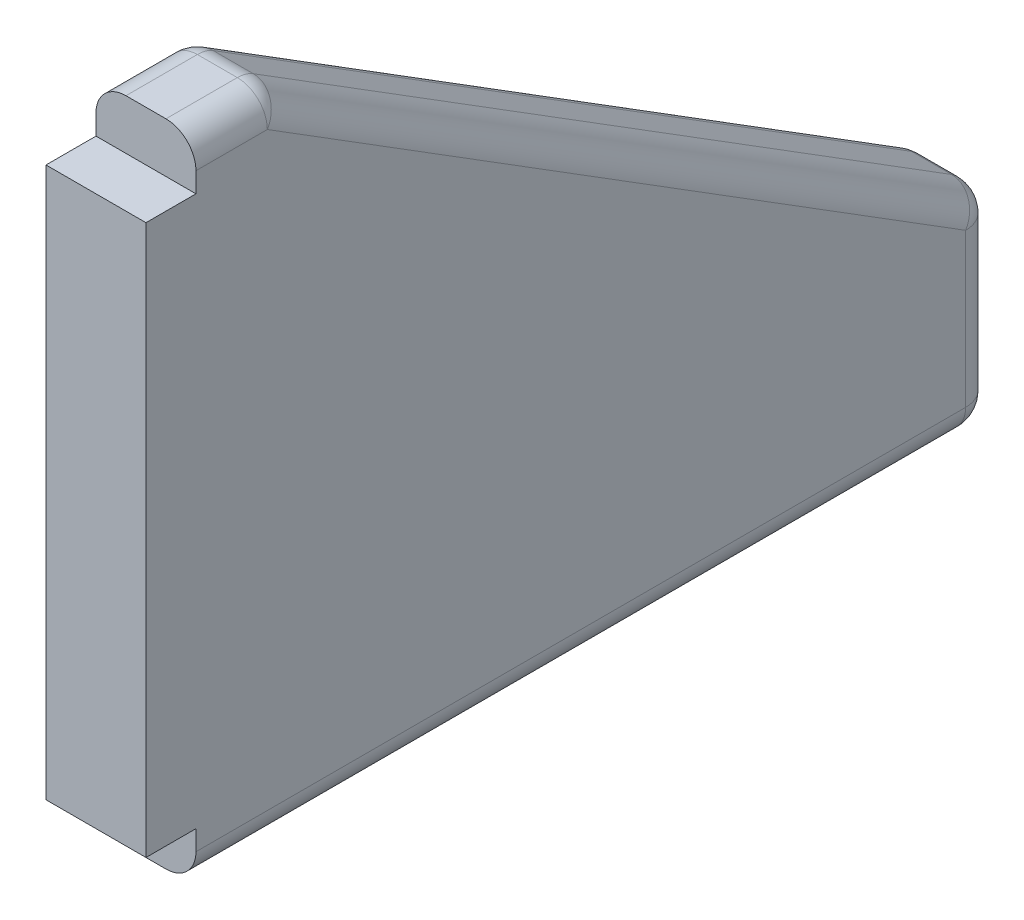
ISO-10303-21;
HEADER;
FILE_DESCRIPTION(('STEP AP214'),'2;1');
FILE_NAME('part.step','',(''),(''),'','','');
FILE_SCHEMA(('AUTOMOTIVE_DESIGN { 1 0 10303 214 1 1 1 1 }'));
ENDSEC;
DATA;
#1=APPLICATION_CONTEXT('core data for automotive mechanical design processes');
#2=APPLICATION_PROTOCOL_DEFINITION('international standard','automotive_design',2000,#1);
#3=PRODUCT_CONTEXT('',#1,'mechanical');
#4=PRODUCT('Part','Part','',(#3));
#5=PRODUCT_RELATED_PRODUCT_CATEGORY('part','',(#4));
#6=PRODUCT_DEFINITION_FORMATION('','',#4);
#7=PRODUCT_DEFINITION_CONTEXT('part definition',#1,'design');
#8=PRODUCT_DEFINITION('design','',#6,#7);
#9=PRODUCT_DEFINITION_SHAPE('','',#8);
#10=(LENGTH_UNIT() NAMED_UNIT(*) SI_UNIT(.MILLI.,.METRE.));
#11=(NAMED_UNIT(*) PLANE_ANGLE_UNIT() SI_UNIT($,.RADIAN.));
#12=(NAMED_UNIT(*) SI_UNIT($,.STERADIAN.) SOLID_ANGLE_UNIT());
#13=UNCERTAINTY_MEASURE_WITH_UNIT(LENGTH_MEASURE(1.E-05),#10,'distance_accuracy_value','');
#14=(GEOMETRIC_REPRESENTATION_CONTEXT(3) GLOBAL_UNCERTAINTY_ASSIGNED_CONTEXT((#13)) GLOBAL_UNIT_ASSIGNED_CONTEXT((#10,
#11,#12)) REPRESENTATION_CONTEXT('',''));
#15=CARTESIAN_POINT('',(0.,0.,0.));
#16=DIRECTION('',(0.,0.,1.));
#17=DIRECTION('',(1.,0.,0.));
#18=AXIS2_PLACEMENT_3D('',#15,#16,#17);
#19=CARTESIAN_POINT('',(10.,0.,-80.));
#20=DIRECTION('',(0.,1.,0.));
#21=DIRECTION('',(0.,0.,1.));
#22=AXIS2_PLACEMENT_3D('',#19,#20,#21);
#23=PLANE('',#22);
#24=DIRECTION('',(-1.,0.,0.));
#25=VECTOR('',#24,1.);
#26=CARTESIAN_POINT('',(10.,0.,0.));
#27=LINE('',#26,#25);
#28=CARTESIAN_POINT('',(7.,0.,0.));
#29=VERTEX_POINT('',#28);
#30=CARTESIAN_POINT('',(3.,0.,0.));
#31=VERTEX_POINT('',#30);
#32=EDGE_CURVE('E199',#29,#31,#27,.T.);
#33=ORIENTED_EDGE('',*,*,#32,.T.);
#34=DIRECTION('',(0.,0.,-1.));
#35=VECTOR('',#34,1.);
#36=CARTESIAN_POINT('',(3.,0.,-80.));
#37=LINE('',#36,#35);
#38=CARTESIAN_POINT('',(3.,0.,-77.));
#39=VERTEX_POINT('',#38);
#40=EDGE_CURVE('E274',#31,#39,#37,.T.);
#41=ORIENTED_EDGE('',*,*,#40,.T.);
#42=DIRECTION('',(-1.,0.,0.));
#43=VECTOR('',#42,1.);
#44=CARTESIAN_POINT('',(10.,0.,-77.));
#45=LINE('',#44,#43);
#46=CARTESIAN_POINT('',(7.,0.,-77.));
#47=VERTEX_POINT('',#46);
#48=EDGE_CURVE('E268',#39,#47,#45,.F.);
#49=ORIENTED_EDGE('',*,*,#48,.T.);
#50=DIRECTION('',(0.,0.,-1.));
#51=VECTOR('',#50,1.);
#52=CARTESIAN_POINT('',(7.,0.,-80.));
#53=LINE('',#52,#51);
#54=EDGE_CURVE('E271',#47,#29,#53,.F.);
#55=ORIENTED_EDGE('',*,*,#54,.T.);
#56=EDGE_LOOP('',(#33,#41,#49,#55));
#57=FACE_BOUND('',#56,.T.);
#58=ADVANCED_FACE('F41',(#57),#23,.F.);
#59=CARTESIAN_POINT('',(10.,20.,-80.));
#60=DIRECTION('',(0.,0.,1.));
#61=DIRECTION('',(1.,0.,0.));
#62=AXIS2_PLACEMENT_3D('',#59,#60,#61);
#63=PLANE('',#62);
#64=DIRECTION('',(0.,1.,0.));
#65=VECTOR('',#64,1.);
#66=CARTESIAN_POINT('',(7.,20.,-80.));
#67=LINE('',#66,#65);
#68=CARTESIAN_POINT('',(7.,18.3372570754788,-80.));
#69=VERTEX_POINT('',#68);
#70=CARTESIAN_POINT('',(7.,3.,-80.));
#71=VERTEX_POINT('',#70);
#72=EDGE_CURVE('E289',#69,#71,#67,.F.);
#73=ORIENTED_EDGE('',*,*,#72,.T.);
#74=DIRECTION('',(-1.,0.,0.));
#75=VECTOR('',#74,1.);
#76=CARTESIAN_POINT('',(10.,3.,-80.));
#77=LINE('',#76,#75);
#78=CARTESIAN_POINT('',(3.,3.,-80.));
#79=VERTEX_POINT('',#78);
#80=EDGE_CURVE('E292',#71,#79,#77,.T.);
#81=ORIENTED_EDGE('',*,*,#80,.T.);
#82=DIRECTION('',(0.,1.,0.));
#83=VECTOR('',#82,1.);
#84=CARTESIAN_POINT('',(3.,20.,-80.));
#85=LINE('',#84,#83);
#86=CARTESIAN_POINT('',(3.,18.3372570754788,-80.));
#87=VERTEX_POINT('',#86);
#88=EDGE_CURVE('E286',#79,#87,#85,.T.);
#89=ORIENTED_EDGE('',*,*,#88,.T.);
#90=DIRECTION('',(-1.,0.,0.));
#91=VECTOR('',#90,1.);
#92=CARTESIAN_POINT('',(10.,18.3372570754788,-80.));
#93=LINE('',#92,#91);
#94=EDGE_CURVE('E283',#87,#69,#93,.F.);
#95=ORIENTED_EDGE('',*,*,#94,.T.);
#96=EDGE_LOOP('',(#73,#81,#89,#95));
#97=FACE_BOUND('',#96,.T.);
#98=ADVANCED_FACE('F461',(#97),#63,.F.);
#99=CARTESIAN_POINT('',(10.,65.,-8.));
#100=DIRECTION('',(0.,-0.847998304005088,0.52999894000318));
#101=DIRECTION('',(0.,-0.52999894000318,-0.847998304005088));
#102=AXIS2_PLACEMENT_3D('',#99,#100,#101);
#103=PLANE('',#102);
#104=DIRECTION('',(-1.,0.,0.));
#105=VECTOR('',#104,1.);
#106=CARTESIAN_POINT('',(10.,20.881251987494,-78.5899968200096));
#107=LINE('',#106,#105);
#108=CARTESIAN_POINT('',(7.,20.881251987494,-78.5899968200095));
#109=VERTEX_POINT('',#108);
#110=CARTESIAN_POINT('',(3.,20.881251987494,-78.5899968200095));
#111=VERTEX_POINT('',#110);
#112=EDGE_CURVE('E51',#109,#111,#107,.T.);
#113=ORIENTED_EDGE('',*,*,#112,.T.);
#114=DIRECTION('',(0.,0.52999894000318,0.847998304005088));
#115=VECTOR('',#114,1.);
#116=CARTESIAN_POINT('',(3.,65.,-8.));
#117=LINE('',#116,#115);
#118=CARTESIAN_POINT('',(3.,64.5439949120153,-8.72960814077558));
#119=VERTEX_POINT('',#118);
#120=EDGE_CURVE('E11',#111,#119,#117,.T.);
#121=ORIENTED_EDGE('',*,*,#120,.T.);
#122=DIRECTION('',(-1.,0.,0.));
#123=VECTOR('',#122,1.);
#124=CARTESIAN_POINT('',(10.,64.5439949120153,-8.72960814077558));
#125=LINE('',#124,#123);
#126=CARTESIAN_POINT('',(7.,64.5439949120153,-8.72960814077558));
#127=VERTEX_POINT('',#126);
#128=EDGE_CURVE('E299',#119,#127,#125,.F.);
#129=ORIENTED_EDGE('',*,*,#128,.T.);
#130=DIRECTION('',(0.,0.52999894000318,0.847998304005088));
#131=VECTOR('',#130,1.);
#132=CARTESIAN_POINT('',(7.,65.,-8.));
#133=LINE('',#132,#131);
#134=EDGE_CURVE('E296',#127,#109,#133,.F.);
#135=ORIENTED_EDGE('',*,*,#134,.T.);
#136=EDGE_LOOP('',(#113,#121,#129,#135));
#137=FACE_BOUND('',#136,.T.);
#138=ADVANCED_FACE('F443',(#137),#103,.F.);
#139=CARTESIAN_POINT('',(10.,65.,0.));
#140=DIRECTION('',(0.,-1.,0.));
#141=DIRECTION('',(0.,0.,-1.));
#142=AXIS2_PLACEMENT_3D('',#139,#140,#141);
#143=PLANE('',#142);
#144=DIRECTION('',(-1.,0.,0.));
#145=VECTOR('',#144,1.);
#146=CARTESIAN_POINT('',(10.,65.,0.));
#147=LINE('',#146,#145);
#148=CARTESIAN_POINT('',(7.,65.,0.));
#149=VERTEX_POINT('',#148);
#150=CARTESIAN_POINT('',(3.,65.,0.));
#151=VERTEX_POINT('',#150);
#152=EDGE_CURVE('E180',#149,#151,#147,.T.);
#153=ORIENTED_EDGE('',*,*,#152,.F.);
#154=DIRECTION('',(0.,0.,1.));
#155=VECTOR('',#154,1.);
#156=CARTESIAN_POINT('',(7.,65.,0.));
#157=LINE('',#156,#155);
#158=CARTESIAN_POINT('',(7.,65.,-7.13961132076604));
#159=VERTEX_POINT('',#158);
#160=EDGE_CURVE('E253',#149,#159,#157,.F.);
#161=ORIENTED_EDGE('',*,*,#160,.T.);
#162=DIRECTION('',(-1.,0.,0.));
#163=VECTOR('',#162,1.);
#164=CARTESIAN_POINT('',(10.,65.,-7.13961132076604));
#165=LINE('',#164,#163);
#166=CARTESIAN_POINT('',(3.,65.,-7.13961132076604));
#167=VERTEX_POINT('',#166);
#168=EDGE_CURVE('E247',#159,#167,#165,.T.);
#169=ORIENTED_EDGE('',*,*,#168,.T.);
#170=DIRECTION('',(0.,0.,1.));
#171=VECTOR('',#170,1.);
#172=CARTESIAN_POINT('',(3.,65.,0.));
#173=LINE('',#172,#171);
#174=EDGE_CURVE('E250',#167,#151,#173,.T.);
#175=ORIENTED_EDGE('',*,*,#174,.T.);
#176=EDGE_LOOP('',(#153,#161,#169,#175));
#177=FACE_BOUND('',#176,.T.);
#178=ADVANCED_FACE('F430',(#177),#143,.F.);
#179=CARTESIAN_POINT('',(10.,60.,0.));
#180=DIRECTION('',(0.,0.,-1.));
#181=DIRECTION('',(0.,1.,0.));
#182=AXIS2_PLACEMENT_3D('',#179,#180,#181);
#183=PLANE('',#182);
#184=DIRECTION('',(0.,-1.,0.));
#185=VECTOR('',#184,1.);
#186=CARTESIAN_POINT('',(10.,60.,0.));
#187=LINE('',#186,#185);
#188=CARTESIAN_POINT('',(10.,62.,0.));
#189=VERTEX_POINT('',#188);
#190=CARTESIAN_POINT('',(10.,60.,0.));
#191=VERTEX_POINT('',#190);
#192=EDGE_CURVE('E160',#189,#191,#187,.T.);
#193=ORIENTED_EDGE('',*,*,#192,.F.);
#194=CARTESIAN_POINT('',(7.,62.,0.));
#195=DIRECTION('',(0.,0.,-1.));
#196=DIRECTION('',(0.,1.,0.));
#197=AXIS2_PLACEMENT_3D('',#194,#195,#196);
#198=CIRCLE('',#197,3.);
#199=EDGE_CURVE('E244',#189,#149,#198,.F.);
#200=ORIENTED_EDGE('',*,*,#199,.T.);
#201=ORIENTED_EDGE('',*,*,#152,.T.);
#202=CARTESIAN_POINT('',(3.,62.,0.));
#203=DIRECTION('',(0.,0.,-1.));
#204=DIRECTION('',(0.,1.,0.));
#205=AXIS2_PLACEMENT_3D('',#202,#203,#204);
#206=CIRCLE('',#205,3.);
#207=CARTESIAN_POINT('',(0.,62.,0.));
#208=VERTEX_POINT('',#207);
#209=EDGE_CURVE('E241',#151,#208,#206,.F.);
#210=ORIENTED_EDGE('',*,*,#209,.T.);
#211=DIRECTION('',(0.,-1.,0.));
#212=VECTOR('',#211,1.);
#213=CARTESIAN_POINT('',(0.,60.,0.));
#214=LINE('',#213,#212);
#215=CARTESIAN_POINT('',(0.,60.,0.));
#216=VERTEX_POINT('',#215);
#217=EDGE_CURVE('E176',#208,#216,#214,.T.);
#218=ORIENTED_EDGE('',*,*,#217,.T.);
#219=DIRECTION('',(-1.,0.,0.));
#220=VECTOR('',#219,1.);
#221=CARTESIAN_POINT('',(10.,60.,0.));
#222=LINE('',#221,#220);
#223=EDGE_CURVE('E173',#191,#216,#222,.T.);
#224=ORIENTED_EDGE('',*,*,#223,.F.);
#225=EDGE_LOOP('',(#193,#200,#201,#210,#218,#224));
#226=FACE_BOUND('',#225,.T.);
#227=ADVANCED_FACE('F174',(#226),#183,.F.);
#228=CARTESIAN_POINT('',(10.,60.,0.));
#229=DIRECTION('',(0.,-1.,0.));
#230=DIRECTION('',(0.,0.,-1.));
#231=AXIS2_PLACEMENT_3D('',#228,#229,#230);
#232=PLANE('',#231);
#233=DIRECTION('',(0.,0.,1.));
#234=VECTOR('',#233,1.);
#235=CARTESIAN_POINT('',(0.,60.,0.));
#236=LINE('',#235,#234);
#237=CARTESIAN_POINT('',(0.,60.,5.));
#238=VERTEX_POINT('',#237);
#239=EDGE_CURVE('E202',#216,#238,#236,.T.);
#240=ORIENTED_EDGE('',*,*,#239,.T.);
#241=DIRECTION('',(-1.,0.,0.));
#242=VECTOR('',#241,1.);
#243=CARTESIAN_POINT('',(10.,60.,5.));
#244=LINE('',#243,#242);
#245=CARTESIAN_POINT('',(10.,60.,5.));
#246=VERTEX_POINT('',#245);
#247=EDGE_CURVE('E181',#246,#238,#244,.T.);
#248=ORIENTED_EDGE('',*,*,#247,.F.);
#249=DIRECTION('',(0.,0.,1.));
#250=VECTOR('',#249,1.);
#251=CARTESIAN_POINT('',(10.,60.,0.));
#252=LINE('',#251,#250);
#253=EDGE_CURVE('E164',#191,#246,#252,.T.);
#254=ORIENTED_EDGE('',*,*,#253,.F.);
#255=ORIENTED_EDGE('',*,*,#223,.T.);
#256=EDGE_LOOP('',(#240,#248,#254,#255));
#257=FACE_BOUND('',#256,.T.);
#258=ADVANCED_FACE('F183',(#257),#232,.F.);
#259=CARTESIAN_POINT('',(10.,60.,5.));
#260=DIRECTION('',(0.,0.,-1.));
#261=DIRECTION('',(0.,1.,0.));
#262=AXIS2_PLACEMENT_3D('',#259,#260,#261);
#263=PLANE('',#262);
#264=DIRECTION('',(0.,-1.,0.));
#265=VECTOR('',#264,1.);
#266=CARTESIAN_POINT('',(0.,60.,5.));
#267=LINE('',#266,#265);
#268=CARTESIAN_POINT('',(0.,5.,4.99999999999999));
#269=VERTEX_POINT('',#268);
#270=EDGE_CURVE('E205',#238,#269,#267,.T.);
#271=ORIENTED_EDGE('',*,*,#270,.T.);
#272=DIRECTION('',(-1.,0.,0.));
#273=VECTOR('',#272,1.);
#274=CARTESIAN_POINT('',(10.,5.,4.99999999999999));
#275=LINE('',#274,#273);
#276=CARTESIAN_POINT('',(10.,5.,4.99999999999999));
#277=VERTEX_POINT('',#276);
#278=EDGE_CURVE('E221',#277,#269,#275,.T.);
#279=ORIENTED_EDGE('',*,*,#278,.F.);
#280=DIRECTION('',(0.,-1.,0.));
#281=VECTOR('',#280,1.);
#282=CARTESIAN_POINT('',(10.,60.,5.));
#283=LINE('',#282,#281);
#284=EDGE_CURVE('E187',#246,#277,#283,.T.);
#285=ORIENTED_EDGE('',*,*,#284,.F.);
#286=ORIENTED_EDGE('',*,*,#247,.T.);
#287=EDGE_LOOP('',(#271,#279,#285,#286));
#288=FACE_BOUND('',#287,.T.);
#289=ADVANCED_FACE('F398',(#288),#263,.F.);
#290=CARTESIAN_POINT('',(10.,5.,0.));
#291=DIRECTION('',(0.,1.,0.));
#292=DIRECTION('',(0.,0.,1.));
#293=AXIS2_PLACEMENT_3D('',#290,#291,#292);
#294=PLANE('',#293);
#295=DIRECTION('',(0.,0.,-1.));
#296=VECTOR('',#295,1.);
#297=CARTESIAN_POINT('',(0.,5.,0.));
#298=LINE('',#297,#296);
#299=CARTESIAN_POINT('',(0.,5.,0.));
#300=VERTEX_POINT('',#299);
#301=EDGE_CURVE('E208',#269,#300,#298,.T.);
#302=ORIENTED_EDGE('',*,*,#301,.T.);
#303=DIRECTION('',(-1.,0.,0.));
#304=VECTOR('',#303,1.);
#305=CARTESIAN_POINT('',(10.,5.,0.));
#306=LINE('',#305,#304);
#307=CARTESIAN_POINT('',(10.,5.,0.));
#308=VERTEX_POINT('',#307);
#309=EDGE_CURVE('E217',#308,#300,#306,.T.);
#310=ORIENTED_EDGE('',*,*,#309,.F.);
#311=DIRECTION('',(0.,0.,-1.));
#312=VECTOR('',#311,1.);
#313=CARTESIAN_POINT('',(10.,5.,0.));
#314=LINE('',#313,#312);
#315=EDGE_CURVE('E190',#277,#308,#314,.T.);
#316=ORIENTED_EDGE('',*,*,#315,.F.);
#317=ORIENTED_EDGE('',*,*,#278,.T.);
#318=EDGE_LOOP('',(#302,#310,#316,#317));
#319=FACE_BOUND('',#318,.T.);
#320=ADVANCED_FACE('F394',(#319),#294,.F.);
#321=CARTESIAN_POINT('',(10.,0.,0.));
#322=DIRECTION('',(0.,0.,-1.));
#323=DIRECTION('',(0.,1.,0.));
#324=AXIS2_PLACEMENT_3D('',#321,#322,#323);
#325=PLANE('',#324);
#326=DIRECTION('',(0.,-1.,0.));
#327=VECTOR('',#326,1.);
#328=CARTESIAN_POINT('',(0.,0.,0.));
#329=LINE('',#328,#327);
#330=CARTESIAN_POINT('',(0.,3.,0.));
#331=VERTEX_POINT('',#330);
#332=EDGE_CURVE('E170',#300,#331,#329,.T.);
#333=ORIENTED_EDGE('',*,*,#332,.T.);
#334=CARTESIAN_POINT('',(3.,3.,0.));
#335=DIRECTION('',(0.,0.,-1.));
#336=DIRECTION('',(0.,1.,0.));
#337=AXIS2_PLACEMENT_3D('',#334,#335,#336);
#338=CIRCLE('',#337,3.);
#339=EDGE_CURVE('E280',#331,#31,#338,.F.);
#340=ORIENTED_EDGE('',*,*,#339,.T.);
#341=ORIENTED_EDGE('',*,*,#32,.F.);
#342=CARTESIAN_POINT('',(7.,3.,0.));
#343=DIRECTION('',(0.,0.,-1.));
#344=DIRECTION('',(0.,1.,0.));
#345=AXIS2_PLACEMENT_3D('',#342,#343,#344);
#346=CIRCLE('',#345,3.);
#347=CARTESIAN_POINT('',(10.,3.,0.));
#348=VERTEX_POINT('',#347);
#349=EDGE_CURVE('E277',#29,#348,#346,.F.);
#350=ORIENTED_EDGE('',*,*,#349,.T.);
#351=DIRECTION('',(0.,-1.,0.));
#352=VECTOR('',#351,1.);
#353=CARTESIAN_POINT('',(10.,0.,0.));
#354=LINE('',#353,#352);
#355=EDGE_CURVE('E195',#308,#348,#354,.T.);
#356=ORIENTED_EDGE('',*,*,#355,.F.);
#357=ORIENTED_EDGE('',*,*,#309,.T.);
#358=EDGE_LOOP('',(#333,#340,#341,#350,#356,#357));
#359=FACE_BOUND('',#358,.T.);
#360=ADVANCED_FACE('F388',(#359),#325,.F.);
#361=CARTESIAN_POINT('',(10.,0.,0.));
#362=DIRECTION('',(-1.,0.,0.));
#363=DIRECTION('',(0.,0.,1.));
#364=AXIS2_PLACEMENT_3D('',#361,#362,#363);
#365=PLANE('',#364);
#366=DIRECTION('',(0.,0.52999894000318,0.847998304005088));
#367=VECTOR('',#366,1.);
#368=CARTESIAN_POINT('',(10.,47.7930837396701,-29.8706773372938));
#369=LINE('',#368,#367);
#370=CARTESIAN_POINT('',(10.,18.3372570754788,-77.));
#371=VERTEX_POINT('',#370);
#372=CARTESIAN_POINT('',(10.,62.,-7.13961132076604));
#373=VERTEX_POINT('',#372);
#374=EDGE_CURVE('E230',#371,#373,#369,.T.);
#375=ORIENTED_EDGE('',*,*,#374,.T.);
#376=DIRECTION('',(0.,0.,1.));
#377=VECTOR('',#376,1.);
#378=CARTESIAN_POINT('',(10.,62.,0.));
#379=LINE('',#378,#377);
#380=EDGE_CURVE('E167',#373,#189,#379,.T.);
#381=ORIENTED_EDGE('',*,*,#380,.T.);
#382=ORIENTED_EDGE('',*,*,#192,.T.);
#383=ORIENTED_EDGE('',*,*,#253,.T.);
#384=ORIENTED_EDGE('',*,*,#284,.T.);
#385=ORIENTED_EDGE('',*,*,#315,.T.);
#386=ORIENTED_EDGE('',*,*,#355,.T.);
#387=DIRECTION('',(0.,0.,-1.));
#388=VECTOR('',#387,1.);
#389=CARTESIAN_POINT('',(10.,3.,0.));
#390=LINE('',#389,#388);
#391=CARTESIAN_POINT('',(10.,3.,-77.));
#392=VERTEX_POINT('',#391);
#393=EDGE_CURVE('E236',#348,#392,#390,.T.);
#394=ORIENTED_EDGE('',*,*,#393,.T.);
#395=DIRECTION('',(0.,1.,0.));
#396=VECTOR('',#395,1.);
#397=CARTESIAN_POINT('',(10.,0.,-77.));
#398=LINE('',#397,#396);
#399=EDGE_CURVE('E233',#392,#371,#398,.T.);
#400=ORIENTED_EDGE('',*,*,#399,.T.);
#401=EDGE_LOOP('',(#375,#381,#382,#383,#384,#385,#386,#394,#400));
#402=FACE_BOUND('',#401,.T.);
#403=ADVANCED_FACE('F162',(#402),#365,.F.);
#404=CARTESIAN_POINT('',(0.,0.,0.));
#405=DIRECTION('',(-1.,0.,0.));
#406=DIRECTION('',(0.,0.,1.));
#407=AXIS2_PLACEMENT_3D('',#404,#405,#406);
#408=PLANE('',#407);
#409=ORIENTED_EDGE('',*,*,#217,.F.);
#410=DIRECTION('',(0.,0.,1.));
#411=VECTOR('',#410,1.);
#412=CARTESIAN_POINT('',(0.,62.,-8.));
#413=LINE('',#412,#411);
#414=CARTESIAN_POINT('',(0.,62.,-7.13961132076605));
#415=VERTEX_POINT('',#414);
#416=EDGE_CURVE('E265',#208,#415,#413,.F.);
#417=ORIENTED_EDGE('',*,*,#416,.T.);
#418=DIRECTION('',(0.,0.52999894000318,0.847998304005088));
#419=VECTOR('',#418,1.);
#420=CARTESIAN_POINT('',(0.,17.4560050879847,-78.4100031799905));
#421=LINE('',#420,#419);
#422=CARTESIAN_POINT('',(0.,18.3372570754788,-77.));
#423=VERTEX_POINT('',#422);
#424=EDGE_CURVE('E256',#415,#423,#421,.F.);
#425=ORIENTED_EDGE('',*,*,#424,.T.);
#426=DIRECTION('',(0.,1.,0.));
#427=VECTOR('',#426,1.);
#428=CARTESIAN_POINT('',(0.,0.,-77.));
#429=LINE('',#428,#427);
#430=CARTESIAN_POINT('',(0.,3.,-77.));
#431=VERTEX_POINT('',#430);
#432=EDGE_CURVE('E259',#423,#431,#429,.F.);
#433=ORIENTED_EDGE('',*,*,#432,.T.);
#434=DIRECTION('',(0.,0.,-1.));
#435=VECTOR('',#434,1.);
#436=CARTESIAN_POINT('',(0.,3.,0.));
#437=LINE('',#436,#435);
#438=EDGE_CURVE('E262',#431,#331,#437,.F.);
#439=ORIENTED_EDGE('',*,*,#438,.T.);
#440=ORIENTED_EDGE('',*,*,#332,.F.);
#441=ORIENTED_EDGE('',*,*,#301,.F.);
#442=ORIENTED_EDGE('',*,*,#270,.F.);
#443=ORIENTED_EDGE('',*,*,#239,.F.);
#444=EDGE_LOOP('',(#409,#417,#425,#433,#439,#440,#441,#442,#443));
#445=FACE_BOUND('',#444,.T.);
#446=ADVANCED_FACE('F385',(#445),#408,.T.);
#447=CARTESIAN_POINT('',(3.,3.,-80.));
#448=DIRECTION('',(0.,0.,1.));
#449=DIRECTION('',(1.,0.,0.));
#450=AXIS2_PLACEMENT_3D('',#447,#448,#449);
#451=CYLINDRICAL_SURFACE('',#450,3.);
#452=CARTESIAN_POINT('',(3.,3.,-77.));
#453=DIRECTION('',(0.,0.,-1.));
#454=DIRECTION('',(-1.,0.,0.));
#455=AXIS2_PLACEMENT_3D('',#452,#453,#454);
#456=CIRCLE('',#455,3.);
#457=EDGE_CURVE('E45',#39,#431,#456,.T.);
#458=ORIENTED_EDGE('',*,*,#457,.F.);
#459=ORIENTED_EDGE('',*,*,#40,.F.);
#460=ORIENTED_EDGE('',*,*,#339,.F.);
#461=ORIENTED_EDGE('',*,*,#438,.F.);
#462=EDGE_LOOP('',(#458,#459,#460,#461));
#463=FACE_BOUND('',#462,.T.);
#464=ADVANCED_FACE('F43',(#463),#451,.T.);
#465=CARTESIAN_POINT('',(3.,3.,-77.));
#466=DIRECTION('',(-1.,0.,0.));
#467=DIRECTION('',(0.,0.,1.));
#468=AXIS2_PLACEMENT_3D('',#465,#466,#467);
#469=SPHERICAL_SURFACE('',#468,3.);
#470=CARTESIAN_POINT('',(3.,3.,-77.));
#471=DIRECTION('',(-1.,0.,0.));
#472=DIRECTION('',(0.,0.,1.));
#473=AXIS2_PLACEMENT_3D('',#470,#471,#472);
#474=CIRCLE('',#473,3.);
#475=EDGE_CURVE('E363',#39,#79,#474,.F.);
#476=ORIENTED_EDGE('',*,*,#475,.F.);
#477=ORIENTED_EDGE('',*,*,#457,.T.);
#478=CARTESIAN_POINT('',(3.,3.,-77.));
#479=DIRECTION('',(0.,-1.,0.));
#480=DIRECTION('',(0.,0.,-1.));
#481=AXIS2_PLACEMENT_3D('',#478,#479,#480);
#482=CIRCLE('',#481,3.);
#483=EDGE_CURVE('E366',#79,#431,#482,.F.);
#484=ORIENTED_EDGE('',*,*,#483,.F.);
#485=EDGE_LOOP('',(#476,#477,#484));
#486=FACE_BOUND('',#485,.T.);
#487=ADVANCED_FACE('F377',(#486),#469,.T.);
#488=CARTESIAN_POINT('',(3.,20.,-77.));
#489=DIRECTION('',(0.,-1.,0.));
#490=DIRECTION('',(0.,0.,-1.));
#491=AXIS2_PLACEMENT_3D('',#488,#489,#490);
#492=CYLINDRICAL_SURFACE('',#491,3.);
#493=ORIENTED_EDGE('',*,*,#483,.T.);
#494=ORIENTED_EDGE('',*,*,#432,.F.);
#495=CARTESIAN_POINT('',(3.,18.3372570754788,-77.));
#496=DIRECTION('',(0.,1.,0.));
#497=DIRECTION('',(-1.,0.,0.));
#498=AXIS2_PLACEMENT_3D('',#495,#496,#497);
#499=CIRCLE('',#498,3.);
#500=EDGE_CURVE('E359',#87,#423,#499,.T.);
#501=ORIENTED_EDGE('',*,*,#500,.F.);
#502=ORIENTED_EDGE('',*,*,#88,.F.);
#503=EDGE_LOOP('',(#493,#494,#501,#502));
#504=FACE_BOUND('',#503,.T.);
#505=ADVANCED_FACE('F568',(#504),#492,.T.);
#506=CARTESIAN_POINT('',(10.,3.,-77.));
#507=DIRECTION('',(-1.,0.,0.));
#508=DIRECTION('',(0.,0.,1.));
#509=AXIS2_PLACEMENT_3D('',#506,#507,#508);
#510=CYLINDRICAL_SURFACE('',#509,3.);
#511=ORIENTED_EDGE('',*,*,#475,.T.);
#512=ORIENTED_EDGE('',*,*,#80,.F.);
#513=CARTESIAN_POINT('',(7.,3.,-77.));
#514=DIRECTION('',(1.,0.,0.));
#515=DIRECTION('',(0.,0.,-1.));
#516=AXIS2_PLACEMENT_3D('',#513,#514,#515);
#517=CIRCLE('',#516,3.);
#518=EDGE_CURVE('E355',#47,#71,#517,.T.);
#519=ORIENTED_EDGE('',*,*,#518,.F.);
#520=ORIENTED_EDGE('',*,*,#48,.F.);
#521=EDGE_LOOP('',(#511,#512,#519,#520));
#522=FACE_BOUND('',#521,.T.);
#523=ADVANCED_FACE('F560',(#522),#510,.T.);
#524=CARTESIAN_POINT('',(7.,3.,0.));
#525=DIRECTION('',(0.,0.,-1.));
#526=DIRECTION('',(-1.,0.,0.));
#527=AXIS2_PLACEMENT_3D('',#524,#525,#526);
#528=CYLINDRICAL_SURFACE('',#527,3.);
#529=ORIENTED_EDGE('',*,*,#349,.F.);
#530=ORIENTED_EDGE('',*,*,#54,.F.);
#531=CARTESIAN_POINT('',(7.,3.,-77.));
#532=DIRECTION('',(0.,0.,-1.));
#533=DIRECTION('',(-1.,0.,0.));
#534=AXIS2_PLACEMENT_3D('',#531,#532,#533);
#535=CIRCLE('',#534,3.);
#536=EDGE_CURVE('E351',#392,#47,#535,.T.);
#537=ORIENTED_EDGE('',*,*,#536,.F.);
#538=ORIENTED_EDGE('',*,*,#393,.F.);
#539=EDGE_LOOP('',(#529,#530,#537,#538));
#540=FACE_BOUND('',#539,.T.);
#541=ADVANCED_FACE('F403',(#540),#528,.T.);
#542=CARTESIAN_POINT('',(3.,18.3372570754788,-77.));
#543=DIRECTION('',(-1.,0.,0.));
#544=DIRECTION('',(0.,-1.,0.));
#545=AXIS2_PLACEMENT_3D('',#542,#543,#544);
#546=SPHERICAL_SURFACE('',#545,3.);
#547=CARTESIAN_POINT('',(3.,18.3372570754788,-77.));
#548=DIRECTION('',(-1.,0.,0.));
#549=DIRECTION('',(0.,0.,1.));
#550=AXIS2_PLACEMENT_3D('',#547,#548,#549);
#551=CIRCLE('',#550,3.);
#552=EDGE_CURVE('E344',#87,#111,#551,.F.);
#553=ORIENTED_EDGE('',*,*,#552,.F.);
#554=ORIENTED_EDGE('',*,*,#500,.T.);
#555=CARTESIAN_POINT('',(3.,18.3372570754788,-77.));
#556=DIRECTION('',(0.,-0.529998940003182,-0.847998304005086));
#557=DIRECTION('',(0.,0.847998304005087,-0.529998940003182));
#558=AXIS2_PLACEMENT_3D('',#555,#556,#557);
#559=CIRCLE('',#558,3.);
#560=EDGE_CURVE('E348',#111,#423,#559,.F.);
#561=ORIENTED_EDGE('',*,*,#560,.F.);
#562=EDGE_LOOP('',(#553,#554,#561));
#563=FACE_BOUND('',#562,.T.);
#564=ADVANCED_FACE('F544',(#563),#546,.T.);
#565=CARTESIAN_POINT('',(7.,3.,-77.));
#566=DIRECTION('',(0.,-1.,0.));
#567=DIRECTION('',(0.,0.,-1.));
#568=AXIS2_PLACEMENT_3D('',#565,#566,#567);
#569=SPHERICAL_SURFACE('',#568,3.);
#570=ORIENTED_EDGE('',*,*,#536,.T.);
#571=ORIENTED_EDGE('',*,*,#518,.T.);
#572=CARTESIAN_POINT('',(7.,3.,-77.));
#573=DIRECTION('',(0.,-1.,0.));
#574=DIRECTION('',(1.,0.,0.));
#575=AXIS2_PLACEMENT_3D('',#572,#573,#574);
#576=CIRCLE('',#575,3.);
#577=EDGE_CURVE('E340',#392,#71,#576,.F.);
#578=ORIENTED_EDGE('',*,*,#577,.F.);
#579=EDGE_LOOP('',(#570,#571,#578));
#580=FACE_BOUND('',#579,.T.);
#581=ADVANCED_FACE('F409',(#580),#569,.T.);
#582=CARTESIAN_POINT('',(3.,62.,0.));
#583=DIRECTION('',(0.,0.,-1.));
#584=DIRECTION('',(-1.,0.,0.));
#585=AXIS2_PLACEMENT_3D('',#582,#583,#584);
#586=CYLINDRICAL_SURFACE('',#585,3.);
#587=ORIENTED_EDGE('',*,*,#209,.F.);
#588=ORIENTED_EDGE('',*,*,#174,.F.);
#589=CARTESIAN_POINT('',(3.,62.,-7.13961132076605));
#590=DIRECTION('',(0.,0.,-1.));
#591=DIRECTION('',(0.,1.,0.));
#592=AXIS2_PLACEMENT_3D('',#589,#590,#591);
#593=CIRCLE('',#592,3.);
#594=EDGE_CURVE('E336',#415,#167,#593,.T.);
#595=ORIENTED_EDGE('',*,*,#594,.F.);
#596=ORIENTED_EDGE('',*,*,#416,.F.);
#597=EDGE_LOOP('',(#587,#588,#595,#596));
#598=FACE_BOUND('',#597,.T.);
#599=ADVANCED_FACE('F435',(#598),#586,.T.);
#600=CARTESIAN_POINT('',(3.,62.4560050879847,-6.41000317999046));
#601=DIRECTION('',(0.,-0.52999894000318,-0.847998304005088));
#602=DIRECTION('',(0.,0.847998304005088,-0.52999894000318));
#603=AXIS2_PLACEMENT_3D('',#600,#601,#602);
#604=CYLINDRICAL_SURFACE('',#603,3.);
#605=ORIENTED_EDGE('',*,*,#560,.T.);
#606=ORIENTED_EDGE('',*,*,#424,.F.);
#607=CARTESIAN_POINT('',(3.,62.,-7.13961132076604));
#608=DIRECTION('',(0.,0.52999894000318,0.847998304005088));
#609=DIRECTION('',(0.,-0.847998304005088,0.52999894000318));
#610=AXIS2_PLACEMENT_3D('',#607,#608,#609);
#611=CIRCLE('',#610,3.);
#612=EDGE_CURVE('E332',#119,#415,#611,.T.);
#613=ORIENTED_EDGE('',*,*,#612,.F.);
#614=ORIENTED_EDGE('',*,*,#120,.F.);
#615=EDGE_LOOP('',(#605,#606,#613,#614));
#616=FACE_BOUND('',#615,.T.);
#617=ADVANCED_FACE('F522',(#616),#604,.T.);
#618=CARTESIAN_POINT('',(10.,18.3372570754788,-77.));
#619=DIRECTION('',(-1.,0.,0.));
#620=DIRECTION('',(0.,0.,1.));
#621=AXIS2_PLACEMENT_3D('',#618,#619,#620);
#622=CYLINDRICAL_SURFACE('',#621,3.);
#623=ORIENTED_EDGE('',*,*,#552,.T.);
#624=ORIENTED_EDGE('',*,*,#112,.F.);
#625=CARTESIAN_POINT('',(7.,18.3372570754788,-77.));
#626=DIRECTION('',(1.,0.,0.));
#627=DIRECTION('',(0.,0.,-1.));
#628=AXIS2_PLACEMENT_3D('',#625,#626,#627);
#629=CIRCLE('',#628,3.);
#630=EDGE_CURVE('E328',#69,#109,#629,.T.);
#631=ORIENTED_EDGE('',*,*,#630,.F.);
#632=ORIENTED_EDGE('',*,*,#94,.F.);
#633=EDGE_LOOP('',(#623,#624,#631,#632));
#634=FACE_BOUND('',#633,.T.);
#635=ADVANCED_FACE('F447',(#634),#622,.T.);
#636=CARTESIAN_POINT('',(7.,0.,-77.));
#637=DIRECTION('',(0.,1.,0.));
#638=DIRECTION('',(0.,0.,1.));
#639=AXIS2_PLACEMENT_3D('',#636,#637,#638);
#640=CYLINDRICAL_SURFACE('',#639,3.);
#641=ORIENTED_EDGE('',*,*,#577,.T.);
#642=ORIENTED_EDGE('',*,*,#72,.F.);
#643=CARTESIAN_POINT('',(7.,18.3372570754788,-77.));
#644=DIRECTION('',(0.,1.,0.));
#645=DIRECTION('',(0.,0.,1.));
#646=AXIS2_PLACEMENT_3D('',#643,#644,#645);
#647=CIRCLE('',#646,3.);
#648=EDGE_CURVE('E324',#371,#69,#647,.T.);
#649=ORIENTED_EDGE('',*,*,#648,.F.);
#650=ORIENTED_EDGE('',*,*,#399,.F.);
#651=EDGE_LOOP('',(#641,#642,#649,#650));
#652=FACE_BOUND('',#651,.T.);
#653=ADVANCED_FACE('F413',(#652),#640,.T.);
#654=CARTESIAN_POINT('',(3.,62.,-7.13961132076604));
#655=DIRECTION('',(-1.,0.,0.));
#656=DIRECTION('',(0.,0.,1.));
#657=AXIS2_PLACEMENT_3D('',#654,#655,#656);
#658=SPHERICAL_SURFACE('',#657,3.);
#659=ORIENTED_EDGE('',*,*,#612,.T.);
#660=ORIENTED_EDGE('',*,*,#594,.T.);
#661=CARTESIAN_POINT('',(3.,62.,-7.13961132076604));
#662=DIRECTION('',(-1.,0.,0.));
#663=DIRECTION('',(0.,0.,1.));
#664=AXIS2_PLACEMENT_3D('',#661,#662,#663);
#665=CIRCLE('',#664,3.);
#666=EDGE_CURVE('E320',#119,#167,#665,.F.);
#667=ORIENTED_EDGE('',*,*,#666,.F.);
#668=EDGE_LOOP('',(#659,#660,#667));
#669=FACE_BOUND('',#668,.T.);
#670=ADVANCED_FACE('F439',(#669),#658,.T.);
#671=CARTESIAN_POINT('',(7.,18.3372570754788,-77.));
#672=DIRECTION('',(1.,0.,0.));
#673=DIRECTION('',(0.,0.,-1.));
#674=AXIS2_PLACEMENT_3D('',#671,#672,#673);
#675=SPHERICAL_SURFACE('',#674,3.);
#676=ORIENTED_EDGE('',*,*,#648,.T.);
#677=ORIENTED_EDGE('',*,*,#630,.T.);
#678=CARTESIAN_POINT('',(7.,18.3372570754788,-77.));
#679=DIRECTION('',(0.,-0.529998940003181,-0.847998304005087));
#680=DIRECTION('',(0.,0.847998304005088,-0.529998940003181));
#681=AXIS2_PLACEMENT_3D('',#678,#679,#680);
#682=CIRCLE('',#681,3.);
#683=EDGE_CURVE('E316',#371,#109,#682,.F.);
#684=ORIENTED_EDGE('',*,*,#683,.F.);
#685=EDGE_LOOP('',(#676,#677,#684));
#686=FACE_BOUND('',#685,.T.);
#687=ADVANCED_FACE('F451',(#686),#675,.T.);
#688=CARTESIAN_POINT('',(10.,62.,-7.13961132076604));
#689=DIRECTION('',(-1.,0.,0.));
#690=DIRECTION('',(0.,0.,1.));
#691=AXIS2_PLACEMENT_3D('',#688,#689,#690);
#692=CYLINDRICAL_SURFACE('',#691,3.);
#693=ORIENTED_EDGE('',*,*,#666,.T.);
#694=ORIENTED_EDGE('',*,*,#168,.F.);
#695=CARTESIAN_POINT('',(7.,62.,-7.13961132076604));
#696=DIRECTION('',(1.,0.,0.));
#697=DIRECTION('',(0.,0.,-1.));
#698=AXIS2_PLACEMENT_3D('',#695,#696,#697);
#699=CIRCLE('',#698,3.);
#700=EDGE_CURVE('E312',#127,#159,#699,.T.);
#701=ORIENTED_EDGE('',*,*,#700,.F.);
#702=ORIENTED_EDGE('',*,*,#128,.F.);
#703=EDGE_LOOP('',(#693,#694,#701,#702));
#704=FACE_BOUND('',#703,.T.);
#705=ADVANCED_FACE('F442',(#704),#692,.T.);
#706=CARTESIAN_POINT('',(7.,47.7930837396701,-29.8706773372938));
#707=DIRECTION('',(0.,0.52999894000318,0.847998304005088));
#708=DIRECTION('',(0.,-0.847998304005088,0.52999894000318));
#709=AXIS2_PLACEMENT_3D('',#706,#707,#708);
#710=CYLINDRICAL_SURFACE('',#709,3.);
#711=ORIENTED_EDGE('',*,*,#683,.T.);
#712=ORIENTED_EDGE('',*,*,#134,.F.);
#713=CARTESIAN_POINT('',(7.,62.,-7.13961132076604));
#714=DIRECTION('',(0.,0.529998940003181,0.847998304005087));
#715=DIRECTION('',(0.,-0.847998304005087,0.529998940003181));
#716=AXIS2_PLACEMENT_3D('',#713,#714,#715);
#717=CIRCLE('',#716,3.);
#718=EDGE_CURVE('E308',#373,#127,#717,.T.);
#719=ORIENTED_EDGE('',*,*,#718,.F.);
#720=ORIENTED_EDGE('',*,*,#374,.F.);
#721=EDGE_LOOP('',(#711,#712,#719,#720));
#722=FACE_BOUND('',#721,.T.);
#723=ADVANCED_FACE('F420',(#722),#710,.T.);
#724=CARTESIAN_POINT('',(7.,62.,-7.13961132076604));
#725=DIRECTION('',(1.,0.,0.));
#726=DIRECTION('',(0.,0.,-1.));
#727=AXIS2_PLACEMENT_3D('',#724,#725,#726);
#728=SPHERICAL_SURFACE('',#727,3.);
#729=ORIENTED_EDGE('',*,*,#718,.T.);
#730=ORIENTED_EDGE('',*,*,#700,.T.);
#731=CARTESIAN_POINT('',(7.,62.,-7.13961132076604));
#732=DIRECTION('',(0.,0.,-1.));
#733=DIRECTION('',(-1.,0.,0.));
#734=AXIS2_PLACEMENT_3D('',#731,#732,#733);
#735=CIRCLE('',#734,3.);
#736=EDGE_CURVE('E304',#373,#159,#735,.F.);
#737=ORIENTED_EDGE('',*,*,#736,.F.);
#738=EDGE_LOOP('',(#729,#730,#737));
#739=FACE_BOUND('',#738,.T.);
#740=ADVANCED_FACE('F423',(#739),#728,.T.);
#741=CARTESIAN_POINT('',(7.,62.,0.));
#742=DIRECTION('',(0.,0.,1.));
#743=DIRECTION('',(1.,0.,0.));
#744=AXIS2_PLACEMENT_3D('',#741,#742,#743);
#745=CYLINDRICAL_SURFACE('',#744,3.);
#746=ORIENTED_EDGE('',*,*,#736,.T.);
#747=ORIENTED_EDGE('',*,*,#160,.F.);
#748=ORIENTED_EDGE('',*,*,#199,.F.);
#749=ORIENTED_EDGE('',*,*,#380,.F.);
#750=EDGE_LOOP('',(#746,#747,#748,#749));
#751=FACE_BOUND('',#750,.T.);
#752=ADVANCED_FACE('F426',(#751),#745,.T.);
#753=CLOSED_SHELL('',(#58,#98,#138,#178,#227,#258,#289,#320,#360,#403,#446,#464,#487,#505,#523,
#541,#564,#581,#599,#617,#635,#653,#670,#687,#705,#723,#740,#752));
#754=MANIFOLD_SOLID_BREP('B2',#753);
#755=ADVANCED_BREP_SHAPE_REPRESENTATION('',(#18,#754),#14);
#756=SHAPE_DEFINITION_REPRESENTATION(#9,#755);
ENDSEC;
END-ISO-10303-21;
